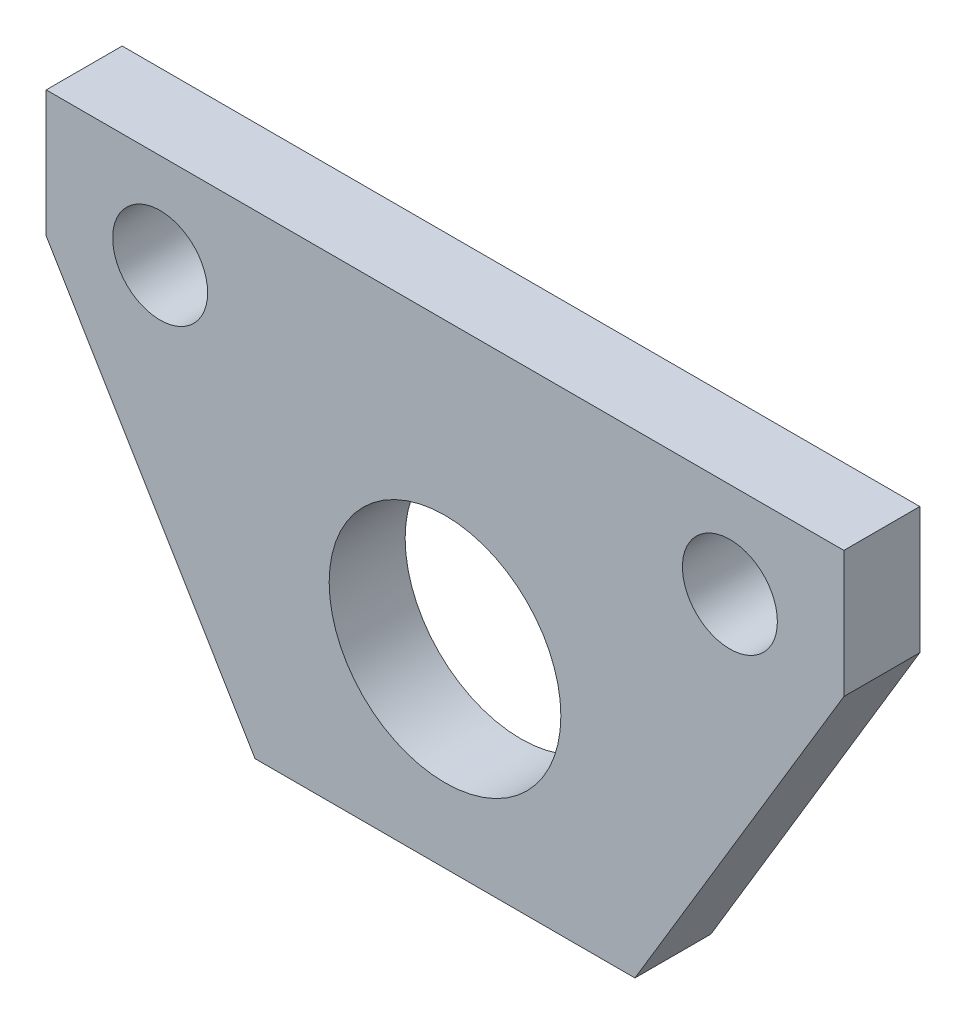
ISO-10303-21;
HEADER;
FILE_DESCRIPTION(('STEP AP214'),'2;1');
FILE_NAME('part.step','',(''),(''),'','','');
FILE_SCHEMA(('AUTOMOTIVE_DESIGN { 1 0 10303 214 1 1 1 1 }'));
ENDSEC;
DATA;
#1=APPLICATION_CONTEXT('core data for automotive mechanical design processes');
#2=APPLICATION_PROTOCOL_DEFINITION('international standard','automotive_design',2000,#1);
#3=PRODUCT_CONTEXT('',#1,'mechanical');
#4=PRODUCT('Part','Part','',(#3));
#5=PRODUCT_RELATED_PRODUCT_CATEGORY('part','',(#4));
#6=PRODUCT_DEFINITION_FORMATION('','',#4);
#7=PRODUCT_DEFINITION_CONTEXT('part definition',#1,'design');
#8=PRODUCT_DEFINITION('design','',#6,#7);
#9=PRODUCT_DEFINITION_SHAPE('','',#8);
#10=(LENGTH_UNIT() NAMED_UNIT(*) SI_UNIT(.MILLI.,.METRE.));
#11=(NAMED_UNIT(*) PLANE_ANGLE_UNIT() SI_UNIT($,.RADIAN.));
#12=(NAMED_UNIT(*) SI_UNIT($,.STERADIAN.) SOLID_ANGLE_UNIT());
#13=UNCERTAINTY_MEASURE_WITH_UNIT(LENGTH_MEASURE(1.E-05),#10,'distance_accuracy_value','');
#14=(GEOMETRIC_REPRESENTATION_CONTEXT(3) GLOBAL_UNCERTAINTY_ASSIGNED_CONTEXT((#13)) GLOBAL_UNIT_ASSIGNED_CONTEXT((#10,
#11,#12)) REPRESENTATION_CONTEXT('',''));
#15=CARTESIAN_POINT('',(0.,0.,0.));
#16=DIRECTION('',(0.,0.,1.));
#17=DIRECTION('',(1.,0.,0.));
#18=AXIS2_PLACEMENT_3D('',#15,#16,#17);
#19=CARTESIAN_POINT('',(-9.33823529411764,-5.60294117647059,5.08));
#20=DIRECTION('',(0.857492925712544,0.514495755427527,0.));
#21=DIRECTION('',(-0.514495755427527,0.857492925712544,0.));
#22=AXIS2_PLACEMENT_3D('',#19,#20,#21);
#23=PLANE('',#22);
#24=DIRECTION('',(0.514495755427527,-0.857492925712544,0.));
#25=VECTOR('',#24,1.);
#26=CARTESIAN_POINT('',(-9.33823529411764,-5.60294117647059,5.08));
#27=LINE('',#26,#25);
#28=CARTESIAN_POINT('',(-26.67,23.2833333333333,5.08));
#29=VERTEX_POINT('',#28);
#30=CARTESIAN_POINT('',(-12.7,0.,5.08));
#31=VERTEX_POINT('',#30);
#32=EDGE_CURVE('E104',#29,#31,#27,.T.);
#33=ORIENTED_EDGE('',*,*,#32,.F.);
#34=DIRECTION('',(0.,0.,1.));
#35=VECTOR('',#34,1.);
#36=CARTESIAN_POINT('',(-26.67,23.2833333333333,0.));
#37=LINE('',#36,#35);
#38=CARTESIAN_POINT('',(-26.67,23.2833333333333,0.));
#39=VERTEX_POINT('',#38);
#40=EDGE_CURVE('E151',#39,#29,#37,.T.);
#41=ORIENTED_EDGE('',*,*,#40,.F.);
#42=DIRECTION('',(0.514495755427527,-0.857492925712544,0.));
#43=VECTOR('',#42,1.);
#44=CARTESIAN_POINT('',(-9.33823529411764,-5.60294117647059,0.));
#45=LINE('',#44,#43);
#46=CARTESIAN_POINT('',(-12.7,0.,0.));
#47=VERTEX_POINT('',#46);
#48=EDGE_CURVE('E121',#39,#47,#45,.T.);
#49=ORIENTED_EDGE('',*,*,#48,.T.);
#50=DIRECTION('',(0.,0.,-1.));
#51=VECTOR('',#50,1.);
#52=CARTESIAN_POINT('',(-12.7,0.,5.08));
#53=LINE('',#52,#51);
#54=EDGE_CURVE('E11',#31,#47,#53,.T.);
#55=ORIENTED_EDGE('',*,*,#54,.F.);
#56=EDGE_LOOP('',(#33,#41,#49,#55));
#57=FACE_BOUND('',#56,.T.);
#58=ADVANCED_FACE('F34',(#57),#23,.F.);
#59=CARTESIAN_POINT('',(0.,0.,5.08));
#60=DIRECTION('',(0.,1.,0.));
#61=DIRECTION('',(0.,0.,1.));
#62=AXIS2_PLACEMENT_3D('',#59,#60,#61);
#63=PLANE('',#62);
#64=DIRECTION('',(1.,0.,0.));
#65=VECTOR('',#64,1.);
#66=CARTESIAN_POINT('',(0.,0.,0.));
#67=LINE('',#66,#65);
#68=CARTESIAN_POINT('',(12.7,0.,0.));
#69=VERTEX_POINT('',#68);
#70=EDGE_CURVE('E109',#47,#69,#67,.T.);
#71=ORIENTED_EDGE('',*,*,#70,.T.);
#72=DIRECTION('',(0.,0.,-1.));
#73=VECTOR('',#72,1.);
#74=CARTESIAN_POINT('',(12.7,0.,5.08));
#75=LINE('',#74,#73);
#76=CARTESIAN_POINT('',(12.7,0.,5.08));
#77=VERTEX_POINT('',#76);
#78=EDGE_CURVE('E41',#77,#69,#75,.T.);
#79=ORIENTED_EDGE('',*,*,#78,.F.);
#80=DIRECTION('',(1.,0.,0.));
#81=VECTOR('',#80,1.);
#82=CARTESIAN_POINT('',(0.,0.,5.08));
#83=LINE('',#82,#81);
#84=EDGE_CURVE('E107',#31,#77,#83,.T.);
#85=ORIENTED_EDGE('',*,*,#84,.F.);
#86=ORIENTED_EDGE('',*,*,#54,.T.);
#87=EDGE_LOOP('',(#71,#79,#85,#86));
#88=FACE_BOUND('',#87,.T.);
#89=ADVANCED_FACE('F125',(#88),#63,.F.);
#90=CARTESIAN_POINT('',(9.33823529411764,-5.60294117647059,5.08));
#91=DIRECTION('',(0.857492925712544,-0.514495755427527,0.));
#92=DIRECTION('',(0.514495755427527,0.857492925712544,0.));
#93=AXIS2_PLACEMENT_3D('',#90,#91,#92);
#94=PLANE('',#93);
#95=DIRECTION('',(0.,0.,1.));
#96=VECTOR('',#95,1.);
#97=CARTESIAN_POINT('',(26.67,23.2833333333333,0.));
#98=LINE('',#97,#96);
#99=CARTESIAN_POINT('',(26.67,23.2833333333333,0.));
#100=VERTEX_POINT('',#99);
#101=CARTESIAN_POINT('',(26.67,23.2833333333333,5.08));
#102=VERTEX_POINT('',#101);
#103=EDGE_CURVE('E48',#100,#102,#98,.T.);
#104=ORIENTED_EDGE('',*,*,#103,.T.);
#105=DIRECTION('',(-0.514495755427527,-0.857492925712544,0.));
#106=VECTOR('',#105,1.);
#107=CARTESIAN_POINT('',(9.33823529411764,-5.60294117647059,5.08));
#108=LINE('',#107,#106);
#109=EDGE_CURVE('E116',#102,#77,#108,.T.);
#110=ORIENTED_EDGE('',*,*,#109,.T.);
#111=ORIENTED_EDGE('',*,*,#78,.T.);
#112=DIRECTION('',(-0.514495755427527,-0.857492925712544,0.));
#113=VECTOR('',#112,1.);
#114=CARTESIAN_POINT('',(9.33823529411764,-5.60294117647059,0.));
#115=LINE('',#114,#113);
#116=EDGE_CURVE('E105',#100,#69,#115,.T.);
#117=ORIENTED_EDGE('',*,*,#116,.F.);
#118=EDGE_LOOP('',(#104,#110,#111,#117));
#119=FACE_BOUND('',#118,.T.);
#120=ADVANCED_FACE('F128',(#119),#94,.T.);
#121=CARTESIAN_POINT('',(0.,31.75,5.08));
#122=DIRECTION('',(0.,1.,0.));
#123=DIRECTION('',(0.,0.,1.));
#124=AXIS2_PLACEMENT_3D('',#121,#122,#123);
#125=PLANE('',#124);
#126=DIRECTION('',(0.,0.,1.));
#127=VECTOR('',#126,1.);
#128=CARTESIAN_POINT('',(-26.67,31.75,0.));
#129=LINE('',#128,#127);
#130=CARTESIAN_POINT('',(-26.67,31.75,0.));
#131=VERTEX_POINT('',#130);
#132=CARTESIAN_POINT('',(-26.67,31.75,5.08));
#133=VERTEX_POINT('',#132);
#134=EDGE_CURVE('E56',#131,#133,#129,.T.);
#135=ORIENTED_EDGE('',*,*,#134,.T.);
#136=DIRECTION('',(1.,0.,0.));
#137=VECTOR('',#136,1.);
#138=CARTESIAN_POINT('',(0.,31.75,5.08));
#139=LINE('',#138,#137);
#140=CARTESIAN_POINT('',(26.67,31.75,5.08));
#141=VERTEX_POINT('',#140);
#142=EDGE_CURVE('E99',#133,#141,#139,.T.);
#143=ORIENTED_EDGE('',*,*,#142,.T.);
#144=DIRECTION('',(0.,0.,1.));
#145=VECTOR('',#144,1.);
#146=CARTESIAN_POINT('',(26.67,31.75,0.));
#147=LINE('',#146,#145);
#148=CARTESIAN_POINT('',(26.67,31.75,0.));
#149=VERTEX_POINT('',#148);
#150=EDGE_CURVE('E86',#149,#141,#147,.T.);
#151=ORIENTED_EDGE('',*,*,#150,.F.);
#152=DIRECTION('',(1.,0.,0.));
#153=VECTOR('',#152,1.);
#154=CARTESIAN_POINT('',(0.,31.75,0.));
#155=LINE('',#154,#153);
#156=EDGE_CURVE('E97',#131,#149,#155,.T.);
#157=ORIENTED_EDGE('',*,*,#156,.F.);
#158=EDGE_LOOP('',(#135,#143,#151,#157));
#159=FACE_BOUND('',#158,.T.);
#160=ADVANCED_FACE('F96',(#159),#125,.T.);
#161=CARTESIAN_POINT('',(0.,0.,5.08));
#162=DIRECTION('',(0.,0.,1.));
#163=DIRECTION('',(1.,0.,0.));
#164=AXIS2_PLACEMENT_3D('',#161,#162,#163);
#165=PLANE('',#164);
#166=CARTESIAN_POINT('',(0.,12.7,5.08));
#167=DIRECTION('',(0.,0.,1.));
#168=DIRECTION('',(1.,0.,0.));
#169=AXIS2_PLACEMENT_3D('',#166,#167,#168);
#170=CIRCLE('',#169,7.747);
#171=CARTESIAN_POINT('',(7.747,12.7,5.08));
#172=VERTEX_POINT('',#171);
#173=EDGE_CURVE('E150',#172,#172,#170,.T.);
#174=ORIENTED_EDGE('',*,*,#173,.F.);
#175=EDGE_LOOP('',(#174));
#176=FACE_BOUND('',#175,.T.);
#177=DIRECTION('',(0.,1.,0.));
#178=VECTOR('',#177,1.);
#179=CARTESIAN_POINT('',(-26.67,23.2833333333333,5.08));
#180=LINE('',#179,#178);
#181=EDGE_CURVE('E154',#29,#133,#180,.T.);
#182=ORIENTED_EDGE('',*,*,#181,.F.);
#183=ORIENTED_EDGE('',*,*,#32,.T.);
#184=ORIENTED_EDGE('',*,*,#84,.T.);
#185=ORIENTED_EDGE('',*,*,#109,.F.);
#186=DIRECTION('',(0.,-1.,0.));
#187=VECTOR('',#186,1.);
#188=CARTESIAN_POINT('',(26.67,31.75,5.08));
#189=LINE('',#188,#187);
#190=EDGE_CURVE('E91',#141,#102,#189,.T.);
#191=ORIENTED_EDGE('',*,*,#190,.F.);
#192=ORIENTED_EDGE('',*,*,#142,.F.);
#193=EDGE_LOOP('',(#182,#183,#184,#185,#191,#192));
#194=FACE_BOUND('',#193,.T.);
#195=CARTESIAN_POINT('',(-19.05,25.4,5.08));
#196=DIRECTION('',(0.,0.,1.));
#197=DIRECTION('',(1.,0.,0.));
#198=AXIS2_PLACEMENT_3D('',#195,#196,#197);
#199=CIRCLE('',#198,3.175);
#200=CARTESIAN_POINT('',(-15.875,25.4,5.08));
#201=VERTEX_POINT('',#200);
#202=EDGE_CURVE('E131',#201,#201,#199,.T.);
#203=ORIENTED_EDGE('',*,*,#202,.F.);
#204=EDGE_LOOP('',(#203));
#205=FACE_BOUND('',#204,.T.);
#206=CARTESIAN_POINT('',(19.05,25.4,5.08));
#207=DIRECTION('',(0.,0.,1.));
#208=DIRECTION('',(1.,0.,0.));
#209=AXIS2_PLACEMENT_3D('',#206,#207,#208);
#210=CIRCLE('',#209,3.175);
#211=CARTESIAN_POINT('',(22.225,25.4,5.08));
#212=VERTEX_POINT('',#211);
#213=EDGE_CURVE('E144',#212,#212,#210,.T.);
#214=ORIENTED_EDGE('',*,*,#213,.F.);
#215=EDGE_LOOP('',(#214));
#216=FACE_BOUND('',#215,.T.);
#217=ADVANCED_FACE('F135',(#176,#194,#205,#216),#165,.T.);
#218=CARTESIAN_POINT('',(0.,0.,0.));
#219=DIRECTION('',(0.,0.,1.));
#220=DIRECTION('',(1.,0.,0.));
#221=AXIS2_PLACEMENT_3D('',#218,#219,#220);
#222=PLANE('',#221);
#223=CARTESIAN_POINT('',(0.,12.7,0.));
#224=DIRECTION('',(0.,0.,1.));
#225=DIRECTION('',(1.,0.,0.));
#226=AXIS2_PLACEMENT_3D('',#223,#224,#225);
#227=CIRCLE('',#226,7.747);
#228=CARTESIAN_POINT('',(7.747,12.7,0.));
#229=VERTEX_POINT('',#228);
#230=EDGE_CURVE('E122',#229,#229,#227,.T.);
#231=ORIENTED_EDGE('',*,*,#230,.T.);
#232=EDGE_LOOP('',(#231));
#233=FACE_BOUND('',#232,.T.);
#234=CARTESIAN_POINT('',(-19.05,25.4,0.));
#235=DIRECTION('',(0.,0.,1.));
#236=DIRECTION('',(1.,0.,0.));
#237=AXIS2_PLACEMENT_3D('',#234,#235,#236);
#238=CIRCLE('',#237,3.175);
#239=CARTESIAN_POINT('',(-15.875,25.4,0.));
#240=VERTEX_POINT('',#239);
#241=EDGE_CURVE('E141',#240,#240,#238,.T.);
#242=ORIENTED_EDGE('',*,*,#241,.T.);
#243=EDGE_LOOP('',(#242));
#244=FACE_BOUND('',#243,.T.);
#245=CARTESIAN_POINT('',(19.05,25.4,0.));
#246=DIRECTION('',(0.,0.,1.));
#247=DIRECTION('',(1.,0.,0.));
#248=AXIS2_PLACEMENT_3D('',#245,#246,#247);
#249=CIRCLE('',#248,3.175);
#250=CARTESIAN_POINT('',(22.225,25.4,0.));
#251=VERTEX_POINT('',#250);
#252=EDGE_CURVE('E147',#251,#251,#249,.T.);
#253=ORIENTED_EDGE('',*,*,#252,.T.);
#254=EDGE_LOOP('',(#253));
#255=FACE_BOUND('',#254,.T.);
#256=ORIENTED_EDGE('',*,*,#48,.F.);
#257=DIRECTION('',(0.,1.,0.));
#258=VECTOR('',#257,1.);
#259=CARTESIAN_POINT('',(-26.67,23.2833333333333,0.));
#260=LINE('',#259,#258);
#261=EDGE_CURVE('E103',#39,#131,#260,.T.);
#262=ORIENTED_EDGE('',*,*,#261,.T.);
#263=ORIENTED_EDGE('',*,*,#156,.T.);
#264=DIRECTION('',(0.,-1.,0.));
#265=VECTOR('',#264,1.);
#266=CARTESIAN_POINT('',(26.67,31.75,0.));
#267=LINE('',#266,#265);
#268=EDGE_CURVE('E83',#149,#100,#267,.T.);
#269=ORIENTED_EDGE('',*,*,#268,.T.);
#270=ORIENTED_EDGE('',*,*,#116,.T.);
#271=ORIENTED_EDGE('',*,*,#70,.F.);
#272=EDGE_LOOP('',(#256,#262,#263,#269,#270,#271));
#273=FACE_BOUND('',#272,.T.);
#274=ADVANCED_FACE('F102',(#233,#244,#255,#273),#222,.F.);
#275=CARTESIAN_POINT('',(19.05,25.4,0.));
#276=DIRECTION('',(0.,0.,1.));
#277=DIRECTION('',(1.,0.,0.));
#278=AXIS2_PLACEMENT_3D('',#275,#276,#277);
#279=CYLINDRICAL_SURFACE('',#278,3.175);
#280=ORIENTED_EDGE('',*,*,#252,.F.);
#281=EDGE_LOOP('',(#280));
#282=FACE_BOUND('',#281,.T.);
#283=ORIENTED_EDGE('',*,*,#213,.T.);
#284=EDGE_LOOP('',(#283));
#285=FACE_BOUND('',#284,.T.);
#286=ADVANCED_FACE('F178',(#282,#285),#279,.F.);
#287=CARTESIAN_POINT('',(-19.05,25.4,0.));
#288=DIRECTION('',(0.,0.,1.));
#289=DIRECTION('',(1.,0.,0.));
#290=AXIS2_PLACEMENT_3D('',#287,#288,#289);
#291=CYLINDRICAL_SURFACE('',#290,3.175);
#292=ORIENTED_EDGE('',*,*,#241,.F.);
#293=EDGE_LOOP('',(#292));
#294=FACE_BOUND('',#293,.T.);
#295=ORIENTED_EDGE('',*,*,#202,.T.);
#296=EDGE_LOOP('',(#295));
#297=FACE_BOUND('',#296,.T.);
#298=ADVANCED_FACE('F193',(#294,#297),#291,.F.);
#299=CARTESIAN_POINT('',(26.67,31.75,0.));
#300=DIRECTION('',(-1.,0.,0.));
#301=DIRECTION('',(0.,-1.,0.));
#302=AXIS2_PLACEMENT_3D('',#299,#300,#301);
#303=PLANE('',#302);
#304=ORIENTED_EDGE('',*,*,#190,.T.);
#305=ORIENTED_EDGE('',*,*,#103,.F.);
#306=ORIENTED_EDGE('',*,*,#268,.F.);
#307=ORIENTED_EDGE('',*,*,#150,.T.);
#308=EDGE_LOOP('',(#304,#305,#306,#307));
#309=FACE_BOUND('',#308,.T.);
#310=ADVANCED_FACE('F85',(#309),#303,.F.);
#311=CARTESIAN_POINT('',(-26.67,23.2833333333333,0.));
#312=DIRECTION('',(1.,0.,0.));
#313=DIRECTION('',(0.,0.,-1.));
#314=AXIS2_PLACEMENT_3D('',#311,#312,#313);
#315=PLANE('',#314);
#316=ORIENTED_EDGE('',*,*,#181,.T.);
#317=ORIENTED_EDGE('',*,*,#134,.F.);
#318=ORIENTED_EDGE('',*,*,#261,.F.);
#319=ORIENTED_EDGE('',*,*,#40,.T.);
#320=EDGE_LOOP('',(#316,#317,#318,#319));
#321=FACE_BOUND('',#320,.T.);
#322=ADVANCED_FACE('F168',(#321),#315,.F.);
#323=CARTESIAN_POINT('',(0.,12.7,0.));
#324=DIRECTION('',(0.,0.,1.));
#325=DIRECTION('',(1.,0.,0.));
#326=AXIS2_PLACEMENT_3D('',#323,#324,#325);
#327=CYLINDRICAL_SURFACE('',#326,7.747);
#328=ORIENTED_EDGE('',*,*,#230,.F.);
#329=EDGE_LOOP('',(#328));
#330=FACE_BOUND('',#329,.T.);
#331=ORIENTED_EDGE('',*,*,#173,.T.);
#332=EDGE_LOOP('',(#331));
#333=FACE_BOUND('',#332,.T.);
#334=ADVANCED_FACE('F165',(#330,#333),#327,.F.);
#335=CLOSED_SHELL('',(#58,#89,#120,#160,#217,#274,#286,#298,#310,#322,#334));
#336=MANIFOLD_SOLID_BREP('B2',#335);
#337=ADVANCED_BREP_SHAPE_REPRESENTATION('',(#18,#336),#14);
#338=SHAPE_DEFINITION_REPRESENTATION(#9,#337);
ENDSEC;
END-ISO-10303-21;
